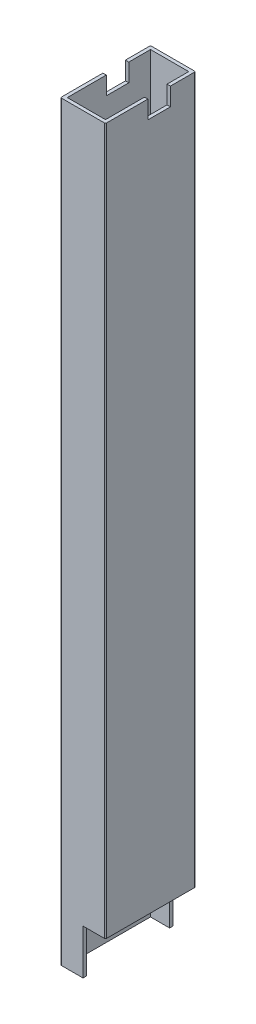
ISO-10303-21;
HEADER;
FILE_DESCRIPTION(('STEP AP214'),'2;1');
FILE_NAME('part.step','',(''),(''),'','','');
FILE_SCHEMA(('AUTOMOTIVE_DESIGN { 1 0 10303 214 1 1 1 1 }'));
ENDSEC;
DATA;
#1=APPLICATION_CONTEXT('core data for automotive mechanical design processes');
#2=APPLICATION_PROTOCOL_DEFINITION('international standard','automotive_design',2000,#1);
#3=PRODUCT_CONTEXT('',#1,'mechanical');
#4=PRODUCT('Part','Part','',(#3));
#5=PRODUCT_RELATED_PRODUCT_CATEGORY('part','',(#4));
#6=PRODUCT_DEFINITION_FORMATION('','',#4);
#7=PRODUCT_DEFINITION_CONTEXT('part definition',#1,'design');
#8=PRODUCT_DEFINITION('design','',#6,#7);
#9=PRODUCT_DEFINITION_SHAPE('','',#8);
#10=(LENGTH_UNIT() NAMED_UNIT(*) SI_UNIT(.MILLI.,.METRE.));
#11=(NAMED_UNIT(*) PLANE_ANGLE_UNIT() SI_UNIT($,.RADIAN.));
#12=(NAMED_UNIT(*) SI_UNIT($,.STERADIAN.) SOLID_ANGLE_UNIT());
#13=UNCERTAINTY_MEASURE_WITH_UNIT(LENGTH_MEASURE(1.E-05),#10,'distance_accuracy_value','');
#14=(GEOMETRIC_REPRESENTATION_CONTEXT(3) GLOBAL_UNCERTAINTY_ASSIGNED_CONTEXT((#13)) GLOBAL_UNIT_ASSIGNED_CONTEXT((#10,
#11,#12)) REPRESENTATION_CONTEXT('',''));
#15=CARTESIAN_POINT('',(0.,0.,0.));
#16=DIRECTION('',(0.,0.,1.));
#17=DIRECTION('',(1.,0.,0.));
#18=AXIS2_PLACEMENT_3D('',#15,#16,#17);
#19=CARTESIAN_POINT('',(19.5,334.,-0.5));
#20=DIRECTION('',(0.,1.,0.));
#21=DIRECTION('',(0.,0.,1.));
#22=AXIS2_PLACEMENT_3D('',#19,#20,#21);
#23=PLANE('',#22);
#24=DIRECTION('',(1.,0.,0.));
#25=VECTOR('',#24,1.);
#26=CARTESIAN_POINT('',(0.,334.,-28.84));
#27=LINE('',#26,#25);
#28=CARTESIAN_POINT('',(18.5,334.,-28.84));
#29=VERTEX_POINT('',#28);
#30=CARTESIAN_POINT('',(20.,334.,-28.84));
#31=VERTEX_POINT('',#30);
#32=EDGE_CURVE('E386',#29,#31,#27,.T.);
#33=ORIENTED_EDGE('',*,*,#32,.T.);
#34=DIRECTION('',(0.,0.,-1.));
#35=VECTOR('',#34,1.);
#36=CARTESIAN_POINT('',(20.,334.,-0.5));
#37=LINE('',#36,#35);
#38=CARTESIAN_POINT('',(20.,334.,-39.5));
#39=VERTEX_POINT('',#38);
#40=EDGE_CURVE('E362',#31,#39,#37,.T.);
#41=ORIENTED_EDGE('',*,*,#40,.T.);
#42=CARTESIAN_POINT('',(19.5,334.,-39.5));
#43=DIRECTION('',(0.,1.,0.));
#44=DIRECTION('',(0.,0.,-1.));
#45=AXIS2_PLACEMENT_3D('',#42,#43,#44);
#46=CIRCLE('',#45,0.5);
#47=CARTESIAN_POINT('',(19.5,334.,-40.));
#48=VERTEX_POINT('',#47);
#49=EDGE_CURVE('E364',#39,#48,#46,.T.);
#50=ORIENTED_EDGE('',*,*,#49,.T.);
#51=DIRECTION('',(-1.,0.,0.));
#52=VECTOR('',#51,1.);
#53=CARTESIAN_POINT('',(0.500000000000004,334.,-40.));
#54=LINE('',#53,#52);
#55=CARTESIAN_POINT('',(0.5,334.,-40.));
#56=VERTEX_POINT('',#55);
#57=EDGE_CURVE('E220',#48,#56,#54,.T.);
#58=ORIENTED_EDGE('',*,*,#57,.T.);
#59=CARTESIAN_POINT('',(0.5,334.,-39.5));
#60=DIRECTION('',(0.,1.,0.));
#61=DIRECTION('',(0.,0.,-1.));
#62=AXIS2_PLACEMENT_3D('',#59,#60,#61);
#63=CIRCLE('',#62,0.5);
#64=CARTESIAN_POINT('',(0.,334.,-39.5));
#65=VERTEX_POINT('',#64);
#66=EDGE_CURVE('E216',#56,#65,#63,.T.);
#67=ORIENTED_EDGE('',*,*,#66,.T.);
#68=DIRECTION('',(0.,0.,1.));
#69=VECTOR('',#68,1.);
#70=CARTESIAN_POINT('',(0.,334.,-0.500000000000004));
#71=LINE('',#70,#69);
#72=CARTESIAN_POINT('',(0.,334.,-28.84));
#73=VERTEX_POINT('',#72);
#74=EDGE_CURVE('E215',#65,#73,#71,.T.);
#75=ORIENTED_EDGE('',*,*,#74,.T.);
#76=CARTESIAN_POINT('',(1.5,334.,-28.84));
#77=VERTEX_POINT('',#76);
#78=EDGE_CURVE('E296',#73,#77,#27,.T.);
#79=ORIENTED_EDGE('',*,*,#78,.T.);
#80=DIRECTION('',(0.,0.,1.));
#81=VECTOR('',#80,1.);
#82=CARTESIAN_POINT('',(1.5,334.,-1.5));
#83=LINE('',#82,#81);
#84=CARTESIAN_POINT('',(1.5,334.,-38.5));
#85=VERTEX_POINT('',#84);
#86=EDGE_CURVE('E334',#85,#77,#83,.T.);
#87=ORIENTED_EDGE('',*,*,#86,.F.);
#88=DIRECTION('',(-1.,0.,0.));
#89=VECTOR('',#88,1.);
#90=CARTESIAN_POINT('',(1.5,334.,-38.5));
#91=LINE('',#90,#89);
#92=CARTESIAN_POINT('',(18.5,334.,-38.5));
#93=VERTEX_POINT('',#92);
#94=EDGE_CURVE('E341',#93,#85,#91,.T.);
#95=ORIENTED_EDGE('',*,*,#94,.F.);
#96=DIRECTION('',(0.,0.,-1.));
#97=VECTOR('',#96,1.);
#98=CARTESIAN_POINT('',(18.5,334.,-1.5));
#99=LINE('',#98,#97);
#100=EDGE_CURVE('E339',#29,#93,#99,.T.);
#101=ORIENTED_EDGE('',*,*,#100,.F.);
#102=EDGE_LOOP('',(#33,#41,#50,#58,#67,#75,#79,#87,#95,#101));
#103=FACE_BOUND('',#102,.T.);
#104=ADVANCED_FACE('F33',(#103),#23,.T.);
#105=DIRECTION('',(1.,0.,0.));
#106=VECTOR('',#105,1.);
#107=CARTESIAN_POINT('',(0.,334.,-18.84));
#108=LINE('',#107,#106);
#109=CARTESIAN_POINT('',(0.,334.,-18.84));
#110=VERTEX_POINT('',#109);
#111=CARTESIAN_POINT('',(1.5,334.,-18.84));
#112=VERTEX_POINT('',#111);
#113=EDGE_CURVE('E48',#110,#112,#108,.T.);
#114=ORIENTED_EDGE('',*,*,#113,.F.);
#115=CARTESIAN_POINT('',(0.,334.,-0.500000000000003));
#116=VERTEX_POINT('',#115);
#117=EDGE_CURVE('E205',#110,#116,#71,.T.);
#118=ORIENTED_EDGE('',*,*,#117,.T.);
#119=CARTESIAN_POINT('',(0.5,334.,-0.5));
#120=DIRECTION('',(0.,1.,0.));
#121=DIRECTION('',(0.,0.,-1.));
#122=AXIS2_PLACEMENT_3D('',#119,#120,#121);
#123=CIRCLE('',#122,0.5);
#124=CARTESIAN_POINT('',(0.500000000000004,334.,0.));
#125=VERTEX_POINT('',#124);
#126=EDGE_CURVE('E219',#116,#125,#123,.T.);
#127=ORIENTED_EDGE('',*,*,#126,.T.);
#128=DIRECTION('',(1.,0.,0.));
#129=VECTOR('',#128,1.);
#130=CARTESIAN_POINT('',(0.500000000000004,334.,0.));
#131=LINE('',#130,#129);
#132=CARTESIAN_POINT('',(19.5,334.,0.));
#133=VERTEX_POINT('',#132);
#134=EDGE_CURVE('E225',#125,#133,#131,.T.);
#135=ORIENTED_EDGE('',*,*,#134,.T.);
#136=CARTESIAN_POINT('',(19.5,334.,-0.5));
#137=DIRECTION('',(0.,1.,0.));
#138=DIRECTION('',(0.,0.,1.));
#139=AXIS2_PLACEMENT_3D('',#136,#137,#138);
#140=CIRCLE('',#139,0.5);
#141=CARTESIAN_POINT('',(20.,334.,-0.5));
#142=VERTEX_POINT('',#141);
#143=EDGE_CURVE('E240',#133,#142,#140,.T.);
#144=ORIENTED_EDGE('',*,*,#143,.T.);
#145=CARTESIAN_POINT('',(20.,334.,-18.84));
#146=VERTEX_POINT('',#145);
#147=EDGE_CURVE('E286',#142,#146,#37,.T.);
#148=ORIENTED_EDGE('',*,*,#147,.T.);
#149=CARTESIAN_POINT('',(18.5,334.,-18.84));
#150=VERTEX_POINT('',#149);
#151=EDGE_CURVE('E209',#150,#146,#108,.T.);
#152=ORIENTED_EDGE('',*,*,#151,.F.);
#153=CARTESIAN_POINT('',(18.5,334.,-1.5));
#154=VERTEX_POINT('',#153);
#155=EDGE_CURVE('E280',#154,#150,#99,.T.);
#156=ORIENTED_EDGE('',*,*,#155,.F.);
#157=DIRECTION('',(1.,0.,0.));
#158=VECTOR('',#157,1.);
#159=CARTESIAN_POINT('',(1.5,334.,-1.5));
#160=LINE('',#159,#158);
#161=CARTESIAN_POINT('',(1.5,334.,-1.5));
#162=VERTEX_POINT('',#161);
#163=EDGE_CURVE('E337',#162,#154,#160,.T.);
#164=ORIENTED_EDGE('',*,*,#163,.F.);
#165=EDGE_CURVE('E208',#112,#162,#83,.T.);
#166=ORIENTED_EDGE('',*,*,#165,.F.);
#167=EDGE_LOOP('',(#114,#118,#127,#135,#144,#148,#152,#156,#164,#166));
#168=FACE_BOUND('',#167,.T.);
#169=ADVANCED_FACE('F204',(#168),#23,.T.);
#170=CARTESIAN_POINT('',(19.5,0.,-0.5));
#171=DIRECTION('',(0.,1.,0.));
#172=DIRECTION('',(0.,0.,1.));
#173=AXIS2_PLACEMENT_3D('',#170,#171,#172);
#174=PLANE('',#173);
#175=DIRECTION('',(-1.,0.,0.));
#176=VECTOR('',#175,1.);
#177=CARTESIAN_POINT('',(0.500000000000004,0.,-40.));
#178=LINE('',#177,#176);
#179=CARTESIAN_POINT('',(10.,0.,-40.));
#180=VERTEX_POINT('',#179);
#181=CARTESIAN_POINT('',(0.5,0.,-40.));
#182=VERTEX_POINT('',#181);
#183=EDGE_CURVE('E228',#180,#182,#178,.T.);
#184=ORIENTED_EDGE('',*,*,#183,.F.);
#185=DIRECTION('',(0.,0.,1.));
#186=VECTOR('',#185,1.);
#187=CARTESIAN_POINT('',(10.,0.,-40.));
#188=LINE('',#187,#186);
#189=CARTESIAN_POINT('',(10.,0.,-38.5));
#190=VERTEX_POINT('',#189);
#191=EDGE_CURVE('E312',#180,#190,#188,.T.);
#192=ORIENTED_EDGE('',*,*,#191,.T.);
#193=DIRECTION('',(-1.,0.,0.));
#194=VECTOR('',#193,1.);
#195=CARTESIAN_POINT('',(1.5,0.,-38.5));
#196=LINE('',#195,#194);
#197=CARTESIAN_POINT('',(1.5,0.,-38.5));
#198=VERTEX_POINT('',#197);
#199=EDGE_CURVE('E349',#190,#198,#196,.T.);
#200=ORIENTED_EDGE('',*,*,#199,.T.);
#201=DIRECTION('',(0.,0.,1.));
#202=VECTOR('',#201,1.);
#203=CARTESIAN_POINT('',(1.5,0.,-1.5));
#204=LINE('',#203,#202);
#205=CARTESIAN_POINT('',(1.5,0.,-1.5));
#206=VERTEX_POINT('',#205);
#207=EDGE_CURVE('E333',#198,#206,#204,.T.);
#208=ORIENTED_EDGE('',*,*,#207,.T.);
#209=DIRECTION('',(1.,0.,0.));
#210=VECTOR('',#209,1.);
#211=CARTESIAN_POINT('',(1.5,0.,-1.5));
#212=LINE('',#211,#210);
#213=CARTESIAN_POINT('',(10.,0.,-1.5));
#214=VERTEX_POINT('',#213);
#215=EDGE_CURVE('E346',#206,#214,#212,.T.);
#216=ORIENTED_EDGE('',*,*,#215,.T.);
#217=CARTESIAN_POINT('',(10.,0.,0.));
#218=VERTEX_POINT('',#217);
#219=EDGE_CURVE('E316',#214,#218,#188,.T.);
#220=ORIENTED_EDGE('',*,*,#219,.T.);
#221=DIRECTION('',(1.,0.,0.));
#222=VECTOR('',#221,1.);
#223=CARTESIAN_POINT('',(0.500000000000004,0.,0.));
#224=LINE('',#223,#222);
#225=CARTESIAN_POINT('',(0.500000000000004,0.,0.));
#226=VERTEX_POINT('',#225);
#227=EDGE_CURVE('E237',#226,#218,#224,.T.);
#228=ORIENTED_EDGE('',*,*,#227,.F.);
#229=CARTESIAN_POINT('',(0.5,0.,-0.5));
#230=DIRECTION('',(0.,1.,0.));
#231=DIRECTION('',(0.,0.,-1.));
#232=AXIS2_PLACEMENT_3D('',#229,#230,#231);
#233=CIRCLE('',#232,0.5);
#234=CARTESIAN_POINT('',(0.,0.,-0.500000000000003));
#235=VERTEX_POINT('',#234);
#236=EDGE_CURVE('E235',#235,#226,#233,.T.);
#237=ORIENTED_EDGE('',*,*,#236,.F.);
#238=DIRECTION('',(0.,0.,1.));
#239=VECTOR('',#238,1.);
#240=CARTESIAN_POINT('',(0.,0.,-0.500000000000004));
#241=LINE('',#240,#239);
#242=CARTESIAN_POINT('',(0.,0.,-39.5));
#243=VERTEX_POINT('',#242);
#244=EDGE_CURVE('E233',#243,#235,#241,.T.);
#245=ORIENTED_EDGE('',*,*,#244,.F.);
#246=CARTESIAN_POINT('',(0.5,0.,-39.5));
#247=DIRECTION('',(0.,1.,0.));
#248=DIRECTION('',(0.,0.,-1.));
#249=AXIS2_PLACEMENT_3D('',#246,#247,#248);
#250=CIRCLE('',#249,0.5);
#251=EDGE_CURVE('E230',#182,#243,#250,.T.);
#252=ORIENTED_EDGE('',*,*,#251,.F.);
#253=EDGE_LOOP('',(#184,#192,#200,#208,#216,#220,#228,#237,#245,#252));
#254=FACE_BOUND('',#253,.T.);
#255=ADVANCED_FACE('F429',(#254),#174,.F.);
#256=CARTESIAN_POINT('',(19.5,334.,-0.5));
#257=DIRECTION('',(0.,-1.,0.));
#258=DIRECTION('',(0.,0.,-1.));
#259=AXIS2_PLACEMENT_3D('',#256,#257,#258);
#260=CYLINDRICAL_SURFACE('',#259,0.5);
#261=DIRECTION('',(0.,-1.,0.));
#262=VECTOR('',#261,1.);
#263=CARTESIAN_POINT('',(19.5,334.,0.));
#264=LINE('',#263,#262);
#265=CARTESIAN_POINT('',(19.5,20.,0.));
#266=VERTEX_POINT('',#265);
#267=EDGE_CURVE('E227',#133,#266,#264,.T.);
#268=ORIENTED_EDGE('',*,*,#267,.T.);
#269=CARTESIAN_POINT('',(19.5,20.,-0.5));
#270=DIRECTION('',(0.,1.,0.));
#271=DIRECTION('',(0.,0.,1.));
#272=AXIS2_PLACEMENT_3D('',#269,#270,#271);
#273=CIRCLE('',#272,0.5);
#274=CARTESIAN_POINT('',(20.,20.,-0.5));
#275=VERTEX_POINT('',#274);
#276=EDGE_CURVE('E328',#266,#275,#273,.T.);
#277=ORIENTED_EDGE('',*,*,#276,.T.);
#278=DIRECTION('',(0.,-1.,0.));
#279=VECTOR('',#278,1.);
#280=CARTESIAN_POINT('',(20.,334.,-0.5));
#281=LINE('',#280,#279);
#282=EDGE_CURVE('E259',#142,#275,#281,.T.);
#283=ORIENTED_EDGE('',*,*,#282,.F.);
#284=ORIENTED_EDGE('',*,*,#143,.F.);
#285=EDGE_LOOP('',(#268,#277,#283,#284));
#286=FACE_BOUND('',#285,.T.);
#287=ADVANCED_FACE('F35',(#286),#260,.T.);
#288=CARTESIAN_POINT('',(20.,334.,-0.5));
#289=DIRECTION('',(-1.,0.,0.));
#290=DIRECTION('',(0.,0.,1.));
#291=AXIS2_PLACEMENT_3D('',#288,#289,#290);
#292=PLANE('',#291);
#293=ORIENTED_EDGE('',*,*,#40,.F.);
#294=DIRECTION('',(0.,1.,0.));
#295=VECTOR('',#294,1.);
#296=CARTESIAN_POINT('',(20.,334.,-28.84));
#297=LINE('',#296,#295);
#298=CARTESIAN_POINT('',(20.,326.,-28.84));
#299=VERTEX_POINT('',#298);
#300=EDGE_CURVE('E200',#299,#31,#297,.T.);
#301=ORIENTED_EDGE('',*,*,#300,.F.);
#302=DIRECTION('',(0.,0.,-1.));
#303=VECTOR('',#302,1.);
#304=CARTESIAN_POINT('',(20.,326.,-28.84));
#305=LINE('',#304,#303);
#306=CARTESIAN_POINT('',(20.,326.,-18.84));
#307=VERTEX_POINT('',#306);
#308=EDGE_CURVE('E410',#307,#299,#305,.T.);
#309=ORIENTED_EDGE('',*,*,#308,.F.);
#310=DIRECTION('',(0.,-1.,0.));
#311=VECTOR('',#310,1.);
#312=CARTESIAN_POINT('',(20.,326.,-18.84));
#313=LINE('',#312,#311);
#314=EDGE_CURVE('E412',#146,#307,#313,.T.);
#315=ORIENTED_EDGE('',*,*,#314,.F.);
#316=ORIENTED_EDGE('',*,*,#147,.F.);
#317=ORIENTED_EDGE('',*,*,#282,.T.);
#318=DIRECTION('',(0.,0.,1.));
#319=VECTOR('',#318,1.);
#320=CARTESIAN_POINT('',(20.,20.,-40.));
#321=LINE('',#320,#319);
#322=CARTESIAN_POINT('',(20.,20.,-39.5));
#323=VERTEX_POINT('',#322);
#324=EDGE_CURVE('E308',#323,#275,#321,.T.);
#325=ORIENTED_EDGE('',*,*,#324,.F.);
#326=DIRECTION('',(0.,-1.,0.));
#327=VECTOR('',#326,1.);
#328=CARTESIAN_POINT('',(20.,334.,-39.5));
#329=LINE('',#328,#327);
#330=EDGE_CURVE('E256',#39,#323,#329,.T.);
#331=ORIENTED_EDGE('',*,*,#330,.F.);
#332=EDGE_LOOP('',(#293,#301,#309,#315,#316,#317,#325,#331));
#333=FACE_BOUND('',#332,.T.);
#334=ADVANCED_FACE('F452',(#333),#292,.F.);
#335=CARTESIAN_POINT('',(19.5,334.,-39.5));
#336=DIRECTION('',(0.,-1.,0.));
#337=DIRECTION('',(0.,0.,-1.));
#338=AXIS2_PLACEMENT_3D('',#335,#336,#337);
#339=CYLINDRICAL_SURFACE('',#338,0.5);
#340=ORIENTED_EDGE('',*,*,#330,.T.);
#341=CARTESIAN_POINT('',(19.5,20.,-39.5));
#342=DIRECTION('',(0.,1.,0.));
#343=DIRECTION('',(0.,0.,1.));
#344=AXIS2_PLACEMENT_3D('',#341,#342,#343);
#345=CIRCLE('',#344,0.5);
#346=CARTESIAN_POINT('',(19.5,20.,-40.));
#347=VERTEX_POINT('',#346);
#348=EDGE_CURVE('E325',#323,#347,#345,.T.);
#349=ORIENTED_EDGE('',*,*,#348,.T.);
#350=DIRECTION('',(0.,-1.,0.));
#351=VECTOR('',#350,1.);
#352=CARTESIAN_POINT('',(19.5,334.,-40.));
#353=LINE('',#352,#351);
#354=EDGE_CURVE('E253',#48,#347,#353,.T.);
#355=ORIENTED_EDGE('',*,*,#354,.F.);
#356=ORIENTED_EDGE('',*,*,#49,.F.);
#357=EDGE_LOOP('',(#340,#349,#355,#356));
#358=FACE_BOUND('',#357,.T.);
#359=ADVANCED_FACE('F450',(#358),#339,.T.);
#360=CARTESIAN_POINT('',(0.500000000000004,334.,-40.));
#361=DIRECTION('',(0.,0.,1.));
#362=DIRECTION('',(1.,0.,0.));
#363=AXIS2_PLACEMENT_3D('',#360,#361,#362);
#364=PLANE('',#363);
#365=DIRECTION('',(-1.,0.,0.));
#366=VECTOR('',#365,1.);
#367=CARTESIAN_POINT('',(20.,20.,-40.));
#368=LINE('',#367,#366);
#369=CARTESIAN_POINT('',(10.,20.,-40.));
#370=VERTEX_POINT('',#369);
#371=EDGE_CURVE('E301',#347,#370,#368,.T.);
#372=ORIENTED_EDGE('',*,*,#371,.T.);
#373=DIRECTION('',(0.,-1.,0.));
#374=VECTOR('',#373,1.);
#375=CARTESIAN_POINT('',(10.,20.,-40.));
#376=LINE('',#375,#374);
#377=EDGE_CURVE('E304',#370,#180,#376,.T.);
#378=ORIENTED_EDGE('',*,*,#377,.T.);
#379=ORIENTED_EDGE('',*,*,#183,.T.);
#380=DIRECTION('',(0.,-1.,0.));
#381=VECTOR('',#380,1.);
#382=CARTESIAN_POINT('',(0.5,334.,-40.));
#383=LINE('',#382,#381);
#384=EDGE_CURVE('E250',#56,#182,#383,.T.);
#385=ORIENTED_EDGE('',*,*,#384,.F.);
#386=ORIENTED_EDGE('',*,*,#57,.F.);
#387=ORIENTED_EDGE('',*,*,#354,.T.);
#388=EDGE_LOOP('',(#372,#378,#379,#385,#386,#387));
#389=FACE_BOUND('',#388,.T.);
#390=ADVANCED_FACE('F374',(#389),#364,.F.);
#391=CARTESIAN_POINT('',(0.5,334.,-39.5));
#392=DIRECTION('',(0.,-1.,0.));
#393=DIRECTION('',(0.,0.,-1.));
#394=AXIS2_PLACEMENT_3D('',#391,#392,#393);
#395=CYLINDRICAL_SURFACE('',#394,0.5);
#396=ORIENTED_EDGE('',*,*,#251,.T.);
#397=DIRECTION('',(0.,-1.,0.));
#398=VECTOR('',#397,1.);
#399=CARTESIAN_POINT('',(0.,334.,-39.5));
#400=LINE('',#399,#398);
#401=EDGE_CURVE('E247',#65,#243,#400,.T.);
#402=ORIENTED_EDGE('',*,*,#401,.F.);
#403=ORIENTED_EDGE('',*,*,#66,.F.);
#404=ORIENTED_EDGE('',*,*,#384,.T.);
#405=EDGE_LOOP('',(#396,#402,#403,#404));
#406=FACE_BOUND('',#405,.T.);
#407=ADVANCED_FACE('F378',(#406),#395,.T.);
#408=CARTESIAN_POINT('',(0.,334.,-0.500000000000004));
#409=DIRECTION('',(1.,0.,0.));
#410=DIRECTION('',(0.,0.,-1.));
#411=AXIS2_PLACEMENT_3D('',#408,#409,#410);
#412=PLANE('',#411);
#413=DIRECTION('',(0.,0.,-1.));
#414=VECTOR('',#413,1.);
#415=CARTESIAN_POINT('',(0.,326.,-28.84));
#416=LINE('',#415,#414);
#417=CARTESIAN_POINT('',(0.,326.,-18.84));
#418=VERTEX_POINT('',#417);
#419=CARTESIAN_POINT('',(0.,326.,-28.84));
#420=VERTEX_POINT('',#419);
#421=EDGE_CURVE('E199',#418,#420,#416,.T.);
#422=ORIENTED_EDGE('',*,*,#421,.T.);
#423=DIRECTION('',(0.,1.,0.));
#424=VECTOR('',#423,1.);
#425=CARTESIAN_POINT('',(0.,334.,-28.84));
#426=LINE('',#425,#424);
#427=EDGE_CURVE('E287',#420,#73,#426,.T.);
#428=ORIENTED_EDGE('',*,*,#427,.T.);
#429=ORIENTED_EDGE('',*,*,#74,.F.);
#430=ORIENTED_EDGE('',*,*,#401,.T.);
#431=ORIENTED_EDGE('',*,*,#244,.T.);
#432=DIRECTION('',(0.,-1.,0.));
#433=VECTOR('',#432,1.);
#434=CARTESIAN_POINT('',(0.,334.,-0.500000000000003));
#435=LINE('',#434,#433);
#436=EDGE_CURVE('E213',#116,#235,#435,.T.);
#437=ORIENTED_EDGE('',*,*,#436,.F.);
#438=ORIENTED_EDGE('',*,*,#117,.F.);
#439=DIRECTION('',(0.,-1.,0.));
#440=VECTOR('',#439,1.);
#441=CARTESIAN_POINT('',(0.,326.,-18.84));
#442=LINE('',#441,#440);
#443=EDGE_CURVE('E191',#110,#418,#442,.T.);
#444=ORIENTED_EDGE('',*,*,#443,.T.);
#445=EDGE_LOOP('',(#422,#428,#429,#430,#431,#437,#438,#444));
#446=FACE_BOUND('',#445,.T.);
#447=ADVANCED_FACE('F211',(#446),#412,.F.);
#448=CARTESIAN_POINT('',(0.5,334.,-0.5));
#449=DIRECTION('',(0.,-1.,0.));
#450=DIRECTION('',(0.,0.,-1.));
#451=AXIS2_PLACEMENT_3D('',#448,#449,#450);
#452=CYLINDRICAL_SURFACE('',#451,0.5);
#453=ORIENTED_EDGE('',*,*,#236,.T.);
#454=DIRECTION('',(0.,-1.,0.));
#455=VECTOR('',#454,1.);
#456=CARTESIAN_POINT('',(0.500000000000004,334.,0.));
#457=LINE('',#456,#455);
#458=EDGE_CURVE('E243',#125,#226,#457,.T.);
#459=ORIENTED_EDGE('',*,*,#458,.F.);
#460=ORIENTED_EDGE('',*,*,#126,.F.);
#461=ORIENTED_EDGE('',*,*,#436,.T.);
#462=EDGE_LOOP('',(#453,#459,#460,#461));
#463=FACE_BOUND('',#462,.T.);
#464=ADVANCED_FACE('F439',(#463),#452,.T.);
#465=CARTESIAN_POINT('',(0.500000000000004,334.,0.));
#466=DIRECTION('',(0.,0.,-1.));
#467=DIRECTION('',(-1.,0.,0.));
#468=AXIS2_PLACEMENT_3D('',#465,#466,#467);
#469=PLANE('',#468);
#470=ORIENTED_EDGE('',*,*,#227,.T.);
#471=DIRECTION('',(0.,-1.,0.));
#472=VECTOR('',#471,1.);
#473=CARTESIAN_POINT('',(10.,20.,0.));
#474=LINE('',#473,#472);
#475=CARTESIAN_POINT('',(10.,20.,0.));
#476=VERTEX_POINT('',#475);
#477=EDGE_CURVE('E305',#476,#218,#474,.T.);
#478=ORIENTED_EDGE('',*,*,#477,.F.);
#479=DIRECTION('',(-1.,0.,0.));
#480=VECTOR('',#479,1.);
#481=CARTESIAN_POINT('',(20.,20.,0.));
#482=LINE('',#481,#480);
#483=EDGE_CURVE('E300',#266,#476,#482,.T.);
#484=ORIENTED_EDGE('',*,*,#483,.F.);
#485=ORIENTED_EDGE('',*,*,#267,.F.);
#486=ORIENTED_EDGE('',*,*,#134,.F.);
#487=ORIENTED_EDGE('',*,*,#458,.T.);
#488=EDGE_LOOP('',(#470,#478,#484,#485,#486,#487));
#489=FACE_BOUND('',#488,.T.);
#490=ADVANCED_FACE('F436',(#489),#469,.F.);
#491=CARTESIAN_POINT('',(1.5,334.,-1.5));
#492=DIRECTION('',(1.,0.,0.));
#493=DIRECTION('',(0.,0.,-1.));
#494=AXIS2_PLACEMENT_3D('',#491,#492,#493);
#495=PLANE('',#494);
#496=DIRECTION('',(0.,1.,0.));
#497=VECTOR('',#496,1.);
#498=CARTESIAN_POINT('',(1.5,334.,-28.84));
#499=LINE('',#498,#497);
#500=CARTESIAN_POINT('',(1.5,326.,-28.84));
#501=VERTEX_POINT('',#500);
#502=EDGE_CURVE('E298',#501,#77,#499,.T.);
#503=ORIENTED_EDGE('',*,*,#502,.F.);
#504=DIRECTION('',(0.,0.,-1.));
#505=VECTOR('',#504,1.);
#506=CARTESIAN_POINT('',(1.5,326.,-1.5));
#507=LINE('',#506,#505);
#508=CARTESIAN_POINT('',(1.5,326.,-18.84));
#509=VERTEX_POINT('',#508);
#510=EDGE_CURVE('E295',#509,#501,#507,.T.);
#511=ORIENTED_EDGE('',*,*,#510,.F.);
#512=DIRECTION('',(0.,-1.,0.));
#513=VECTOR('',#512,1.);
#514=CARTESIAN_POINT('',(1.5,334.,-18.84));
#515=LINE('',#514,#513);
#516=EDGE_CURVE('E293',#112,#509,#515,.T.);
#517=ORIENTED_EDGE('',*,*,#516,.F.);
#518=ORIENTED_EDGE('',*,*,#165,.T.);
#519=DIRECTION('',(0.,-1.,0.));
#520=VECTOR('',#519,1.);
#521=CARTESIAN_POINT('',(1.5,334.,-1.5));
#522=LINE('',#521,#520);
#523=EDGE_CURVE('E231',#162,#206,#522,.T.);
#524=ORIENTED_EDGE('',*,*,#523,.T.);
#525=ORIENTED_EDGE('',*,*,#207,.F.);
#526=DIRECTION('',(0.,-1.,0.));
#527=VECTOR('',#526,1.);
#528=CARTESIAN_POINT('',(1.5,334.,-38.5));
#529=LINE('',#528,#527);
#530=EDGE_CURVE('E343',#85,#198,#529,.T.);
#531=ORIENTED_EDGE('',*,*,#530,.F.);
#532=ORIENTED_EDGE('',*,*,#86,.T.);
#533=EDGE_LOOP('',(#503,#511,#517,#518,#524,#525,#531,#532));
#534=FACE_BOUND('',#533,.T.);
#535=ADVANCED_FACE('F391',(#534),#495,.T.);
#536=CARTESIAN_POINT('',(1.5,334.,-1.5));
#537=DIRECTION('',(0.,0.,-1.));
#538=DIRECTION('',(-1.,0.,0.));
#539=AXIS2_PLACEMENT_3D('',#536,#537,#538);
#540=PLANE('',#539);
#541=DIRECTION('',(0.,1.,0.));
#542=VECTOR('',#541,1.);
#543=CARTESIAN_POINT('',(10.,334.,-1.5));
#544=LINE('',#543,#542);
#545=CARTESIAN_POINT('',(10.,20.,-1.5));
#546=VERTEX_POINT('',#545);
#547=EDGE_CURVE('E331',#214,#546,#544,.T.);
#548=ORIENTED_EDGE('',*,*,#547,.F.);
#549=ORIENTED_EDGE('',*,*,#215,.F.);
#550=ORIENTED_EDGE('',*,*,#523,.F.);
#551=ORIENTED_EDGE('',*,*,#163,.T.);
#552=DIRECTION('',(0.,-1.,0.));
#553=VECTOR('',#552,1.);
#554=CARTESIAN_POINT('',(18.5,334.,-1.5));
#555=LINE('',#554,#553);
#556=CARTESIAN_POINT('',(18.5,20.,-1.5));
#557=VERTEX_POINT('',#556);
#558=EDGE_CURVE('E356',#154,#557,#555,.T.);
#559=ORIENTED_EDGE('',*,*,#558,.T.);
#560=DIRECTION('',(1.,0.,0.));
#561=VECTOR('',#560,1.);
#562=CARTESIAN_POINT('',(1.5,20.,-1.5));
#563=LINE('',#562,#561);
#564=EDGE_CURVE('E323',#546,#557,#563,.T.);
#565=ORIENTED_EDGE('',*,*,#564,.F.);
#566=EDGE_LOOP('',(#548,#549,#550,#551,#559,#565));
#567=FACE_BOUND('',#566,.T.);
#568=ADVANCED_FACE('F485',(#567),#540,.T.);
#569=CARTESIAN_POINT('',(18.5,334.,-1.5));
#570=DIRECTION('',(-1.,0.,0.));
#571=DIRECTION('',(0.,0.,1.));
#572=AXIS2_PLACEMENT_3D('',#569,#570,#571);
#573=PLANE('',#572);
#574=DIRECTION('',(0.,-1.,0.));
#575=VECTOR('',#574,1.);
#576=CARTESIAN_POINT('',(18.5,334.,-28.84));
#577=LINE('',#576,#575);
#578=CARTESIAN_POINT('',(18.5,326.,-28.84));
#579=VERTEX_POINT('',#578);
#580=EDGE_CURVE('E11',#29,#579,#577,.T.);
#581=ORIENTED_EDGE('',*,*,#580,.F.);
#582=ORIENTED_EDGE('',*,*,#100,.T.);
#583=DIRECTION('',(0.,-1.,0.));
#584=VECTOR('',#583,1.);
#585=CARTESIAN_POINT('',(18.5,334.,-38.5));
#586=LINE('',#585,#584);
#587=CARTESIAN_POINT('',(18.5,20.0000000000001,-38.5));
#588=VERTEX_POINT('',#587);
#589=EDGE_CURVE('E353',#93,#588,#586,.T.);
#590=ORIENTED_EDGE('',*,*,#589,.T.);
#591=DIRECTION('',(0.,0.,-1.));
#592=VECTOR('',#591,1.);
#593=CARTESIAN_POINT('',(18.5,20.,-1.5));
#594=LINE('',#593,#592);
#595=EDGE_CURVE('E315',#557,#588,#594,.T.);
#596=ORIENTED_EDGE('',*,*,#595,.F.);
#597=ORIENTED_EDGE('',*,*,#558,.F.);
#598=ORIENTED_EDGE('',*,*,#155,.T.);
#599=DIRECTION('',(0.,1.,0.));
#600=VECTOR('',#599,1.);
#601=CARTESIAN_POINT('',(18.5,334.,-18.84));
#602=LINE('',#601,#600);
#603=CARTESIAN_POINT('',(18.5,326.,-18.84));
#604=VERTEX_POINT('',#603);
#605=EDGE_CURVE('E266',#604,#150,#602,.T.);
#606=ORIENTED_EDGE('',*,*,#605,.F.);
#607=DIRECTION('',(0.,0.,1.));
#608=VECTOR('',#607,1.);
#609=CARTESIAN_POINT('',(18.5,326.,-1.5));
#610=LINE('',#609,#608);
#611=EDGE_CURVE('E41',#579,#604,#610,.T.);
#612=ORIENTED_EDGE('',*,*,#611,.F.);
#613=EDGE_LOOP('',(#581,#582,#590,#596,#597,#598,#606,#612));
#614=FACE_BOUND('',#613,.T.);
#615=ADVANCED_FACE('F277',(#614),#573,.T.);
#616=CARTESIAN_POINT('',(1.5,334.,-38.5));
#617=DIRECTION('',(0.,0.,1.));
#618=DIRECTION('',(1.,0.,0.));
#619=AXIS2_PLACEMENT_3D('',#616,#617,#618);
#620=PLANE('',#619);
#621=DIRECTION('',(0.,-1.,0.));
#622=VECTOR('',#621,1.);
#623=CARTESIAN_POINT('',(10.,334.,-38.5));
#624=LINE('',#623,#622);
#625=CARTESIAN_POINT('',(10.,20.,-38.5));
#626=VERTEX_POINT('',#625);
#627=EDGE_CURVE('E264',#626,#190,#624,.T.);
#628=ORIENTED_EDGE('',*,*,#627,.F.);
#629=DIRECTION('',(-1.,0.,0.));
#630=VECTOR('',#629,1.);
#631=CARTESIAN_POINT('',(1.5,20.,-38.5));
#632=LINE('',#631,#630);
#633=EDGE_CURVE('E262',#588,#626,#632,.T.);
#634=ORIENTED_EDGE('',*,*,#633,.F.);
#635=ORIENTED_EDGE('',*,*,#589,.F.);
#636=ORIENTED_EDGE('',*,*,#94,.T.);
#637=ORIENTED_EDGE('',*,*,#530,.T.);
#638=ORIENTED_EDGE('',*,*,#199,.F.);
#639=EDGE_LOOP('',(#628,#634,#635,#636,#637,#638));
#640=FACE_BOUND('',#639,.T.);
#641=ADVANCED_FACE('F397',(#640),#620,.T.);
#642=CARTESIAN_POINT('',(10.,20.,-40.));
#643=DIRECTION('',(-1.,0.,0.));
#644=DIRECTION('',(0.,0.,1.));
#645=AXIS2_PLACEMENT_3D('',#642,#643,#644);
#646=PLANE('',#645);
#647=ORIENTED_EDGE('',*,*,#547,.T.);
#648=DIRECTION('',(0.,0.,1.));
#649=VECTOR('',#648,1.);
#650=CARTESIAN_POINT('',(10.,20.,-40.));
#651=LINE('',#650,#649);
#652=EDGE_CURVE('E320',#546,#476,#651,.T.);
#653=ORIENTED_EDGE('',*,*,#652,.T.);
#654=ORIENTED_EDGE('',*,*,#477,.T.);
#655=ORIENTED_EDGE('',*,*,#219,.F.);
#656=EDGE_LOOP('',(#647,#653,#654,#655));
#657=FACE_BOUND('',#656,.T.);
#658=ADVANCED_FACE('F481',(#657),#646,.F.);
#659=CARTESIAN_POINT('',(20.,20.,-40.));
#660=DIRECTION('',(0.,1.,0.));
#661=DIRECTION('',(0.,0.,1.));
#662=AXIS2_PLACEMENT_3D('',#659,#660,#661);
#663=PLANE('',#662);
#664=ORIENTED_EDGE('',*,*,#483,.T.);
#665=ORIENTED_EDGE('',*,*,#652,.F.);
#666=ORIENTED_EDGE('',*,*,#564,.T.);
#667=ORIENTED_EDGE('',*,*,#595,.T.);
#668=ORIENTED_EDGE('',*,*,#633,.T.);
#669=EDGE_CURVE('E317',#370,#626,#651,.T.);
#670=ORIENTED_EDGE('',*,*,#669,.F.);
#671=ORIENTED_EDGE('',*,*,#371,.F.);
#672=ORIENTED_EDGE('',*,*,#348,.F.);
#673=ORIENTED_EDGE('',*,*,#324,.T.);
#674=ORIENTED_EDGE('',*,*,#276,.F.);
#675=EDGE_LOOP('',(#664,#665,#666,#667,#668,#670,#671,#672,#673,#674));
#676=FACE_BOUND('',#675,.T.);
#677=ADVANCED_FACE('F465',(#676),#663,.F.);
#678=ORIENTED_EDGE('',*,*,#627,.T.);
#679=ORIENTED_EDGE('',*,*,#191,.F.);
#680=ORIENTED_EDGE('',*,*,#377,.F.);
#681=ORIENTED_EDGE('',*,*,#669,.T.);
#682=EDGE_LOOP('',(#678,#679,#680,#681));
#683=FACE_BOUND('',#682,.T.);
#684=ADVANCED_FACE('F467',(#683),#646,.F.);
#685=CARTESIAN_POINT('',(0.,326.,-18.84));
#686=DIRECTION('',(0.,0.,1.));
#687=DIRECTION('',(1.,0.,0.));
#688=AXIS2_PLACEMENT_3D('',#685,#686,#687);
#689=PLANE('',#688);
#690=ORIENTED_EDGE('',*,*,#605,.T.);
#691=ORIENTED_EDGE('',*,*,#151,.T.);
#692=ORIENTED_EDGE('',*,*,#314,.T.);
#693=DIRECTION('',(1.,0.,0.));
#694=VECTOR('',#693,1.);
#695=CARTESIAN_POINT('',(0.,326.,-18.84));
#696=LINE('',#695,#694);
#697=EDGE_CURVE('E56',#604,#307,#696,.T.);
#698=ORIENTED_EDGE('',*,*,#697,.F.);
#699=EDGE_LOOP('',(#690,#691,#692,#698));
#700=FACE_BOUND('',#699,.T.);
#701=ADVANCED_FACE('F282',(#700),#689,.F.);
#702=CARTESIAN_POINT('',(0.,326.,-28.84));
#703=DIRECTION('',(0.,-1.,0.));
#704=DIRECTION('',(0.,0.,-1.));
#705=AXIS2_PLACEMENT_3D('',#702,#703,#704);
#706=PLANE('',#705);
#707=ORIENTED_EDGE('',*,*,#611,.T.);
#708=ORIENTED_EDGE('',*,*,#697,.T.);
#709=ORIENTED_EDGE('',*,*,#308,.T.);
#710=DIRECTION('',(1.,0.,0.));
#711=VECTOR('',#710,1.);
#712=CARTESIAN_POINT('',(0.,326.,-28.84));
#713=LINE('',#712,#711);
#714=EDGE_CURVE('E273',#579,#299,#713,.T.);
#715=ORIENTED_EDGE('',*,*,#714,.F.);
#716=EDGE_LOOP('',(#707,#708,#709,#715));
#717=FACE_BOUND('',#716,.T.);
#718=ADVANCED_FACE('F271',(#717),#706,.F.);
#719=CARTESIAN_POINT('',(0.,334.,-28.84));
#720=DIRECTION('',(0.,0.,-1.));
#721=DIRECTION('',(-1.,0.,0.));
#722=AXIS2_PLACEMENT_3D('',#719,#720,#721);
#723=PLANE('',#722);
#724=ORIENTED_EDGE('',*,*,#580,.T.);
#725=ORIENTED_EDGE('',*,*,#714,.T.);
#726=ORIENTED_EDGE('',*,*,#300,.T.);
#727=ORIENTED_EDGE('',*,*,#32,.F.);
#728=EDGE_LOOP('',(#724,#725,#726,#727));
#729=FACE_BOUND('',#728,.T.);
#730=ADVANCED_FACE('F404',(#729),#723,.F.);
#731=ORIENTED_EDGE('',*,*,#502,.T.);
#732=ORIENTED_EDGE('',*,*,#78,.F.);
#733=ORIENTED_EDGE('',*,*,#427,.F.);
#734=EDGE_CURVE('E406',#420,#501,#713,.T.);
#735=ORIENTED_EDGE('',*,*,#734,.T.);
#736=EDGE_LOOP('',(#731,#732,#733,#735));
#737=FACE_BOUND('',#736,.T.);
#738=ADVANCED_FACE('F416',(#737),#723,.F.);
#739=ORIENTED_EDGE('',*,*,#510,.T.);
#740=ORIENTED_EDGE('',*,*,#734,.F.);
#741=ORIENTED_EDGE('',*,*,#421,.F.);
#742=EDGE_CURVE('E194',#418,#509,#696,.T.);
#743=ORIENTED_EDGE('',*,*,#742,.T.);
#744=EDGE_LOOP('',(#739,#740,#741,#743));
#745=FACE_BOUND('',#744,.T.);
#746=ADVANCED_FACE('F415',(#745),#706,.F.);
#747=ORIENTED_EDGE('',*,*,#516,.T.);
#748=ORIENTED_EDGE('',*,*,#742,.F.);
#749=ORIENTED_EDGE('',*,*,#443,.F.);
#750=ORIENTED_EDGE('',*,*,#113,.T.);
#751=EDGE_LOOP('',(#747,#748,#749,#750));
#752=FACE_BOUND('',#751,.T.);
#753=ADVANCED_FACE('F192',(#752),#689,.F.);
#754=CLOSED_SHELL('',(#104,#169,#255,#287,#334,#359,#390,#407,#447,#464,#490,#535,#568,#615,
#641,#658,#677,#684,#701,#718,#730,#738,#746,#753));
#755=MANIFOLD_SOLID_BREP('B2',#754);
#756=ADVANCED_BREP_SHAPE_REPRESENTATION('',(#18,#755),#14);
#757=SHAPE_DEFINITION_REPRESENTATION(#9,#756);
ENDSEC;
END-ISO-10303-21;
